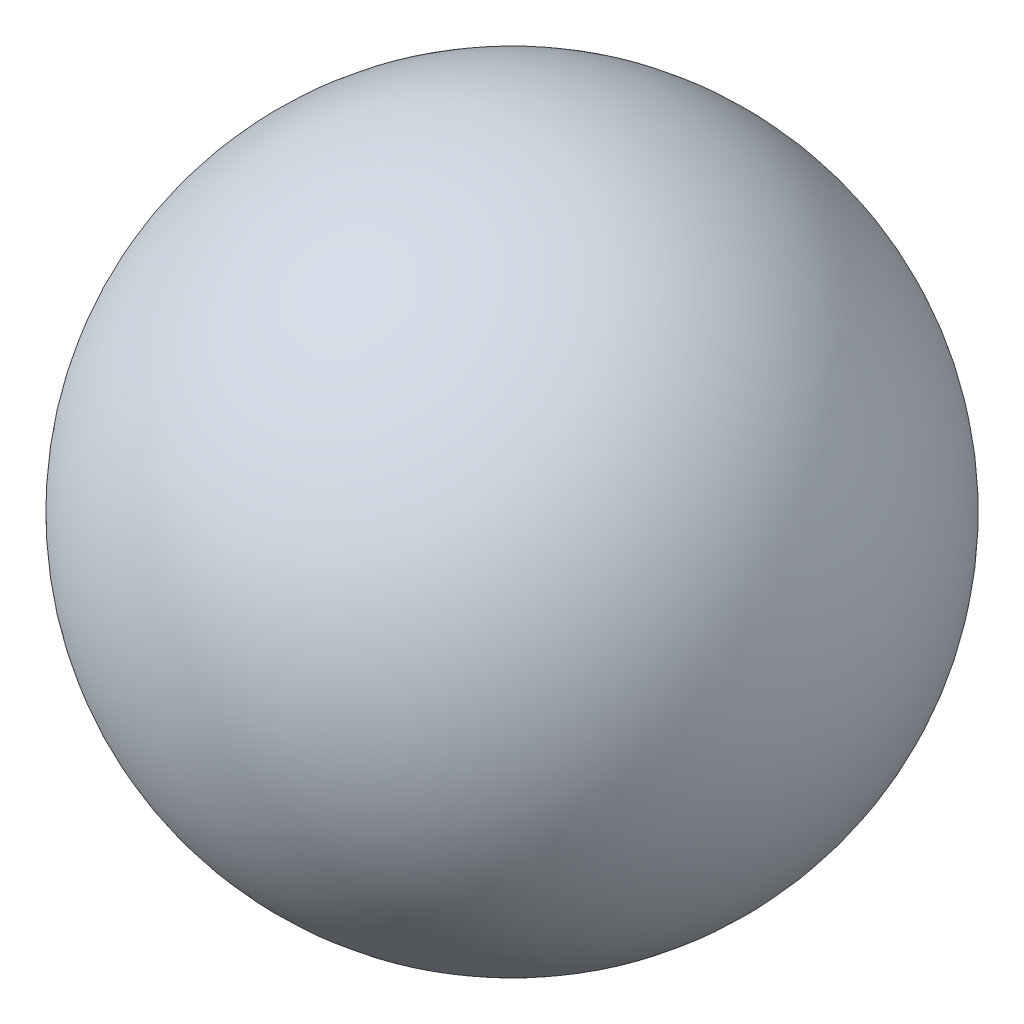
ISO-10303-21;
HEADER;
FILE_DESCRIPTION(('STEP AP214'),'2;1');
FILE_NAME('part.step','',(''),(''),'','','');
FILE_SCHEMA(('AUTOMOTIVE_DESIGN { 1 0 10303 214 1 1 1 1 }'));
ENDSEC;
DATA;
#1=APPLICATION_CONTEXT('core data for automotive mechanical design processes');
#2=APPLICATION_PROTOCOL_DEFINITION('international standard','automotive_design',2000,#1);
#3=PRODUCT_CONTEXT('',#1,'mechanical');
#4=PRODUCT('Part','Part','',(#3));
#5=PRODUCT_RELATED_PRODUCT_CATEGORY('part','',(#4));
#6=PRODUCT_DEFINITION_FORMATION('','',#4);
#7=PRODUCT_DEFINITION_CONTEXT('part definition',#1,'design');
#8=PRODUCT_DEFINITION('design','',#6,#7);
#9=PRODUCT_DEFINITION_SHAPE('','',#8);
#10=(LENGTH_UNIT() NAMED_UNIT(*) SI_UNIT(.MILLI.,.METRE.));
#11=(NAMED_UNIT(*) PLANE_ANGLE_UNIT() SI_UNIT($,.RADIAN.));
#12=(NAMED_UNIT(*) SI_UNIT($,.STERADIAN.) SOLID_ANGLE_UNIT());
#13=UNCERTAINTY_MEASURE_WITH_UNIT(LENGTH_MEASURE(1.E-05),#10,'distance_accuracy_value','');
#14=(GEOMETRIC_REPRESENTATION_CONTEXT(3) GLOBAL_UNCERTAINTY_ASSIGNED_CONTEXT((#13)) GLOBAL_UNIT_ASSIGNED_CONTEXT((#10,
#11,#12)) REPRESENTATION_CONTEXT('',''));
#15=CARTESIAN_POINT('',(0.,0.,0.));
#16=DIRECTION('',(0.,0.,1.));
#17=DIRECTION('',(1.,0.,0.));
#18=AXIS2_PLACEMENT_3D('',#15,#16,#17);
#19=CARTESIAN_POINT('',(0.,0.,0.));
#20=DIRECTION('',(0.,1.,0.));
#21=DIRECTION('',(1.,0.,0.));
#22=AXIS2_PLACEMENT_3D('',#19,#20,#21);
#23=SPHERICAL_SURFACE('',#22,1.);
#24=CARTESIAN_POINT('',(0.,1.,0.));
#25=VERTEX_POINT('',#24);
#26=VERTEX_LOOP('',#25);
#27=FACE_BOUND('',#26,.T.);
#28=ADVANCED_FACE('F32',(#27),#23,.T.);
#29=CLOSED_SHELL('',(#28));
#30=MANIFOLD_SOLID_BREP('B2',#29);
#31=ADVANCED_BREP_SHAPE_REPRESENTATION('',(#18,#30),#14);
#32=SHAPE_DEFINITION_REPRESENTATION(#9,#31);
ENDSEC;
END-ISO-10303-21;
